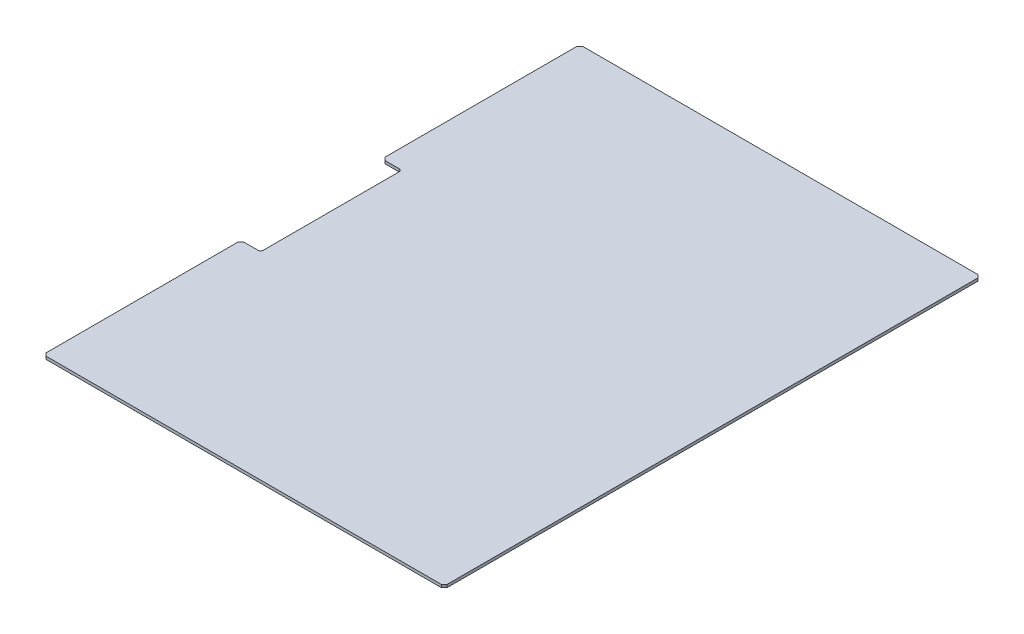
ISO-10303-21;
HEADER;
FILE_DESCRIPTION(('STEP AP214'),'2;1');
FILE_NAME('part.step','',(''),(''),'','','');
FILE_SCHEMA(('AUTOMOTIVE_DESIGN { 1 0 10303 214 1 1 1 1 }'));
ENDSEC;
DATA;
#1=APPLICATION_CONTEXT('core data for automotive mechanical design processes');
#2=APPLICATION_PROTOCOL_DEFINITION('international standard','automotive_design',2000,#1);
#3=PRODUCT_CONTEXT('',#1,'mechanical');
#4=PRODUCT('Part','Part','',(#3));
#5=PRODUCT_RELATED_PRODUCT_CATEGORY('part','',(#4));
#6=PRODUCT_DEFINITION_FORMATION('','',#4);
#7=PRODUCT_DEFINITION_CONTEXT('part definition',#1,'design');
#8=PRODUCT_DEFINITION('design','',#6,#7);
#9=PRODUCT_DEFINITION_SHAPE('','',#8);
#10=(LENGTH_UNIT() NAMED_UNIT(*) SI_UNIT(.MILLI.,.METRE.));
#11=(NAMED_UNIT(*) PLANE_ANGLE_UNIT() SI_UNIT($,.RADIAN.));
#12=(NAMED_UNIT(*) SI_UNIT($,.STERADIAN.) SOLID_ANGLE_UNIT());
#13=UNCERTAINTY_MEASURE_WITH_UNIT(LENGTH_MEASURE(1.E-05),#10,'distance_accuracy_value','');
#14=(GEOMETRIC_REPRESENTATION_CONTEXT(3) GLOBAL_UNCERTAINTY_ASSIGNED_CONTEXT((#13)) GLOBAL_UNIT_ASSIGNED_CONTEXT((#10,
#11,#12)) REPRESENTATION_CONTEXT('',''));
#15=CARTESIAN_POINT('',(0.,0.,0.));
#16=DIRECTION('',(0.,0.,1.));
#17=DIRECTION('',(1.,0.,0.));
#18=AXIS2_PLACEMENT_3D('',#15,#16,#17);
#19=CARTESIAN_POINT('',(50.8,-6.35,52.5536723434925));
#20=DIRECTION('',(-1.,0.,0.));
#21=DIRECTION('',(0.,0.,1.));
#22=AXIS2_PLACEMENT_3D('',#19,#20,#21);
#23=PLANE('',#22);
#24=DIRECTION('',(0.,0.,1.));
#25=VECTOR('',#24,1.);
#26=CARTESIAN_POINT('',(50.8,0.,52.5536723434925));
#27=LINE('',#26,#25);
#28=CARTESIAN_POINT('',(50.8,0.,768.35));
#29=VERTEX_POINT('',#28);
#30=CARTESIAN_POINT('',(50.8,0.,1200.15));
#31=VERTEX_POINT('',#30);
#32=EDGE_CURVE('E197',#29,#31,#27,.T.);
#33=ORIENTED_EDGE('',*,*,#32,.F.);
#34=DIRECTION('',(0.,-1.,0.));
#35=VECTOR('',#34,1.);
#36=CARTESIAN_POINT('',(50.8,-6.35,768.35));
#37=LINE('',#36,#35);
#38=CARTESIAN_POINT('',(50.8,-6.35,768.35));
#39=VERTEX_POINT('',#38);
#40=EDGE_CURVE('E171',#29,#39,#37,.T.);
#41=ORIENTED_EDGE('',*,*,#40,.T.);
#42=DIRECTION('',(0.,0.,1.));
#43=VECTOR('',#42,1.);
#44=CARTESIAN_POINT('',(50.8,-6.35,52.5536723434925));
#45=LINE('',#44,#43);
#46=CARTESIAN_POINT('',(50.8,-6.35,1200.15));
#47=VERTEX_POINT('',#46);
#48=EDGE_CURVE('E225',#39,#47,#45,.T.);
#49=ORIENTED_EDGE('',*,*,#48,.T.);
#50=DIRECTION('',(0.,1.,0.));
#51=VECTOR('',#50,1.);
#52=CARTESIAN_POINT('',(50.8,-6.35,1200.15));
#53=LINE('',#52,#51);
#54=EDGE_CURVE('E177',#47,#31,#53,.T.);
#55=ORIENTED_EDGE('',*,*,#54,.T.);
#56=EDGE_LOOP('',(#33,#41,#49,#55));
#57=FACE_BOUND('',#56,.T.);
#58=ADVANCED_FACE('F16',(#57),#23,.T.);
#59=CARTESIAN_POINT('',(121.105415511131,-6.35,762.));
#60=DIRECTION('',(0.,0.,1.));
#61=DIRECTION('',(1.,0.,0.));
#62=AXIS2_PLACEMENT_3D('',#59,#60,#61);
#63=PLANE('',#62);
#64=DIRECTION('',(1.,0.,0.));
#65=VECTOR('',#64,1.);
#66=CARTESIAN_POINT('',(121.105415511131,0.,762.));
#67=LINE('',#66,#65);
#68=CARTESIAN_POINT('',(57.15,0.,762.));
#69=VERTEX_POINT('',#68);
#70=CARTESIAN_POINT('',(88.9,0.,762.));
#71=VERTEX_POINT('',#70);
#72=EDGE_CURVE('E184',#69,#71,#67,.T.);
#73=ORIENTED_EDGE('',*,*,#72,.T.);
#74=DIRECTION('',(0.,1.,0.));
#75=VECTOR('',#74,1.);
#76=CARTESIAN_POINT('',(88.9,-6.35,762.));
#77=LINE('',#76,#75);
#78=CARTESIAN_POINT('',(88.9,-6.35,762.));
#79=VERTEX_POINT('',#78);
#80=EDGE_CURVE('E300',#71,#79,#77,.F.);
#81=ORIENTED_EDGE('',*,*,#80,.T.);
#82=DIRECTION('',(1.,0.,0.));
#83=VECTOR('',#82,1.);
#84=CARTESIAN_POINT('',(121.105415511131,-6.35,762.));
#85=LINE('',#84,#83);
#86=CARTESIAN_POINT('',(57.15,-6.35,762.));
#87=VERTEX_POINT('',#86);
#88=EDGE_CURVE('E187',#87,#79,#85,.T.);
#89=ORIENTED_EDGE('',*,*,#88,.F.);
#90=DIRECTION('',(0.,1.,0.));
#91=VECTOR('',#90,1.);
#92=CARTESIAN_POINT('',(57.15,0.,762.));
#93=LINE('',#92,#91);
#94=EDGE_CURVE('E170',#87,#69,#93,.T.);
#95=ORIENTED_EDGE('',*,*,#94,.T.);
#96=EDGE_LOOP('',(#73,#81,#89,#95));
#97=FACE_BOUND('',#96,.T.);
#98=ADVANCED_FACE('F183',(#97),#63,.F.);
#99=CARTESIAN_POINT('',(95.25,-6.35,626.005172729492));
#100=DIRECTION('',(1.,0.,0.));
#101=DIRECTION('',(0.,0.,-1.));
#102=AXIS2_PLACEMENT_3D('',#99,#100,#101);
#103=PLANE('',#102);
#104=DIRECTION('',(0.,0.,-1.));
#105=VECTOR('',#104,1.);
#106=CARTESIAN_POINT('',(95.25,-6.35,626.005172729492));
#107=LINE('',#106,#105);
#108=CARTESIAN_POINT('',(95.25,-6.35,755.65));
#109=VERTEX_POINT('',#108);
#110=CARTESIAN_POINT('',(95.25,-6.35,450.85));
#111=VERTEX_POINT('',#110);
#112=EDGE_CURVE('E325',#109,#111,#107,.T.);
#113=ORIENTED_EDGE('',*,*,#112,.F.);
#114=DIRECTION('',(0.,1.,0.));
#115=VECTOR('',#114,1.);
#116=CARTESIAN_POINT('',(95.25,0.,755.65));
#117=LINE('',#116,#115);
#118=CARTESIAN_POINT('',(95.25,0.,755.65));
#119=VERTEX_POINT('',#118);
#120=EDGE_CURVE('E296',#109,#119,#117,.T.);
#121=ORIENTED_EDGE('',*,*,#120,.T.);
#122=DIRECTION('',(0.,0.,-1.));
#123=VECTOR('',#122,1.);
#124=CARTESIAN_POINT('',(95.25,0.,626.005172729492));
#125=LINE('',#124,#123);
#126=CARTESIAN_POINT('',(95.25,0.,450.85));
#127=VERTEX_POINT('',#126);
#128=EDGE_CURVE('E196',#119,#127,#125,.T.);
#129=ORIENTED_EDGE('',*,*,#128,.T.);
#130=DIRECTION('',(0.,1.,0.));
#131=VECTOR('',#130,1.);
#132=CARTESIAN_POINT('',(95.25,-6.35,450.85));
#133=LINE('',#132,#131);
#134=EDGE_CURVE('E293',#127,#111,#133,.F.);
#135=ORIENTED_EDGE('',*,*,#134,.T.);
#136=EDGE_LOOP('',(#113,#121,#129,#135));
#137=FACE_BOUND('',#136,.T.);
#138=ADVANCED_FACE('F316',(#137),#103,.F.);
#139=CARTESIAN_POINT('',(121.105415511131,-6.35,444.5));
#140=DIRECTION('',(0.,0.,1.));
#141=DIRECTION('',(1.,0.,0.));
#142=AXIS2_PLACEMENT_3D('',#139,#140,#141);
#143=PLANE('',#142);
#144=DIRECTION('',(1.,0.,0.));
#145=VECTOR('',#144,1.);
#146=CARTESIAN_POINT('',(121.105415511131,-6.35,444.5));
#147=LINE('',#146,#145);
#148=CARTESIAN_POINT('',(57.15,-6.35,444.5));
#149=VERTEX_POINT('',#148);
#150=CARTESIAN_POINT('',(88.9,-6.35,444.5));
#151=VERTEX_POINT('',#150);
#152=EDGE_CURVE('E321',#149,#151,#147,.T.);
#153=ORIENTED_EDGE('',*,*,#152,.T.);
#154=DIRECTION('',(0.,1.,0.));
#155=VECTOR('',#154,1.);
#156=CARTESIAN_POINT('',(88.9,-6.35,444.5));
#157=LINE('',#156,#155);
#158=CARTESIAN_POINT('',(88.9,0.,444.5));
#159=VERTEX_POINT('',#158);
#160=EDGE_CURVE('E303',#151,#159,#157,.T.);
#161=ORIENTED_EDGE('',*,*,#160,.T.);
#162=DIRECTION('',(1.,0.,0.));
#163=VECTOR('',#162,1.);
#164=CARTESIAN_POINT('',(121.105415511131,0.,444.5));
#165=LINE('',#164,#163);
#166=CARTESIAN_POINT('',(57.15,0.,444.5));
#167=VERTEX_POINT('',#166);
#168=EDGE_CURVE('E204',#167,#159,#165,.T.);
#169=ORIENTED_EDGE('',*,*,#168,.F.);
#170=DIRECTION('',(0.,-1.,0.));
#171=VECTOR('',#170,1.);
#172=CARTESIAN_POINT('',(57.15,-6.35,444.5));
#173=LINE('',#172,#171);
#174=EDGE_CURVE('E269',#167,#149,#173,.T.);
#175=ORIENTED_EDGE('',*,*,#174,.T.);
#176=EDGE_LOOP('',(#153,#161,#169,#175));
#177=FACE_BOUND('',#176,.T.);
#178=ADVANCED_FACE('F319',(#177),#143,.T.);
#179=CARTESIAN_POINT('',(50.8,-6.35,6.35));
#180=VERTEX_POINT('',#179);
#181=CARTESIAN_POINT('',(50.8,-6.35,438.15));
#182=VERTEX_POINT('',#181);
#183=EDGE_CURVE('E324',#180,#182,#45,.T.);
#184=ORIENTED_EDGE('',*,*,#183,.T.);
#185=DIRECTION('',(0.,1.,0.));
#186=VECTOR('',#185,1.);
#187=CARTESIAN_POINT('',(50.8,-6.35,438.15));
#188=LINE('',#187,#186);
#189=CARTESIAN_POINT('',(50.8,0.,438.15));
#190=VERTEX_POINT('',#189);
#191=EDGE_CURVE('E265',#182,#190,#188,.T.);
#192=ORIENTED_EDGE('',*,*,#191,.T.);
#193=CARTESIAN_POINT('',(50.8,0.,6.35));
#194=VERTEX_POINT('',#193);
#195=EDGE_CURVE('E208',#194,#190,#27,.T.);
#196=ORIENTED_EDGE('',*,*,#195,.F.);
#197=DIRECTION('',(0.,-1.,0.));
#198=VECTOR('',#197,1.);
#199=CARTESIAN_POINT('',(50.8,-6.35,6.35));
#200=LINE('',#199,#198);
#201=EDGE_CURVE('E262',#194,#180,#200,.T.);
#202=ORIENTED_EDGE('',*,*,#201,.T.);
#203=EDGE_LOOP('',(#184,#192,#196,#202));
#204=FACE_BOUND('',#203,.T.);
#205=ADVANCED_FACE('F376',(#204),#23,.T.);
#206=CARTESIAN_POINT('',(123.701680451632,-6.35,0.));
#207=DIRECTION('',(0.,0.,1.));
#208=DIRECTION('',(1.,0.,0.));
#209=AXIS2_PLACEMENT_3D('',#206,#207,#208);
#210=PLANE('',#209);
#211=DIRECTION('',(1.,0.,0.));
#212=VECTOR('',#211,1.);
#213=CARTESIAN_POINT('',(123.701680451632,-6.35,0.));
#214=LINE('',#213,#212);
#215=CARTESIAN_POINT('',(57.15,-6.35,0.));
#216=VERTEX_POINT('',#215);
#217=CARTESIAN_POINT('',(946.15,-6.35,0.));
#218=VERTEX_POINT('',#217);
#219=EDGE_CURVE('E330',#216,#218,#214,.T.);
#220=ORIENTED_EDGE('',*,*,#219,.F.);
#221=DIRECTION('',(0.,1.,0.));
#222=VECTOR('',#221,1.);
#223=CARTESIAN_POINT('',(57.15,0.,0.));
#224=LINE('',#223,#222);
#225=CARTESIAN_POINT('',(57.15,0.,0.));
#226=VERTEX_POINT('',#225);
#227=EDGE_CURVE('E275',#216,#226,#224,.T.);
#228=ORIENTED_EDGE('',*,*,#227,.T.);
#229=DIRECTION('',(1.,0.,0.));
#230=VECTOR('',#229,1.);
#231=CARTESIAN_POINT('',(123.701680451632,0.,0.));
#232=LINE('',#231,#230);
#233=CARTESIAN_POINT('',(946.15,0.,0.));
#234=VERTEX_POINT('',#233);
#235=EDGE_CURVE('E214',#226,#234,#232,.T.);
#236=ORIENTED_EDGE('',*,*,#235,.T.);
#237=DIRECTION('',(0.,-1.,0.));
#238=VECTOR('',#237,1.);
#239=CARTESIAN_POINT('',(946.15,-6.35,0.));
#240=LINE('',#239,#238);
#241=EDGE_CURVE('E272',#234,#218,#240,.T.);
#242=ORIENTED_EDGE('',*,*,#241,.T.);
#243=EDGE_LOOP('',(#220,#228,#236,#242));
#244=FACE_BOUND('',#243,.T.);
#245=ADVANCED_FACE('F367',(#244),#210,.F.);
#246=CARTESIAN_POINT('',(952.5,-6.35,52.5536723434928));
#247=DIRECTION('',(-1.,0.,0.));
#248=DIRECTION('',(0.,0.,1.));
#249=AXIS2_PLACEMENT_3D('',#246,#247,#248);
#250=PLANE('',#249);
#251=DIRECTION('',(0.,0.,1.));
#252=VECTOR('',#251,1.);
#253=CARTESIAN_POINT('',(952.5,-6.35,52.5536723434928));
#254=LINE('',#253,#252);
#255=CARTESIAN_POINT('',(952.5,-6.35,6.35));
#256=VERTEX_POINT('',#255);
#257=CARTESIAN_POINT('',(952.5,-6.35,1200.15));
#258=VERTEX_POINT('',#257);
#259=EDGE_CURVE('E338',#256,#258,#254,.T.);
#260=ORIENTED_EDGE('',*,*,#259,.F.);
#261=DIRECTION('',(0.,1.,0.));
#262=VECTOR('',#261,1.);
#263=CARTESIAN_POINT('',(952.5,-6.35,6.35));
#264=LINE('',#263,#262);
#265=CARTESIAN_POINT('',(952.5,0.,6.35));
#266=VERTEX_POINT('',#265);
#267=EDGE_CURVE('E282',#256,#266,#264,.T.);
#268=ORIENTED_EDGE('',*,*,#267,.T.);
#269=DIRECTION('',(0.,0.,1.));
#270=VECTOR('',#269,1.);
#271=CARTESIAN_POINT('',(952.5,0.,52.5536723434928));
#272=LINE('',#271,#270);
#273=CARTESIAN_POINT('',(952.5,0.,1200.15));
#274=VERTEX_POINT('',#273);
#275=EDGE_CURVE('E218',#266,#274,#272,.T.);
#276=ORIENTED_EDGE('',*,*,#275,.T.);
#277=DIRECTION('',(0.,-1.,0.));
#278=VECTOR('',#277,1.);
#279=CARTESIAN_POINT('',(952.5,-6.35,1200.15));
#280=LINE('',#279,#278);
#281=EDGE_CURVE('E279',#274,#258,#280,.T.);
#282=ORIENTED_EDGE('',*,*,#281,.T.);
#283=EDGE_LOOP('',(#260,#268,#276,#282));
#284=FACE_BOUND('',#283,.T.);
#285=ADVANCED_FACE('F358',(#284),#250,.F.);
#286=CARTESIAN_POINT('',(123.701680451632,-6.35,1206.5));
#287=DIRECTION('',(0.,0.,1.));
#288=DIRECTION('',(1.,0.,0.));
#289=AXIS2_PLACEMENT_3D('',#286,#287,#288);
#290=PLANE('',#289);
#291=DIRECTION('',(1.,0.,0.));
#292=VECTOR('',#291,1.);
#293=CARTESIAN_POINT('',(123.701680451632,0.,1206.5));
#294=LINE('',#293,#292);
#295=CARTESIAN_POINT('',(57.15,0.,1206.5));
#296=VERTEX_POINT('',#295);
#297=CARTESIAN_POINT('',(946.15,0.,1206.5));
#298=VERTEX_POINT('',#297);
#299=EDGE_CURVE('E222',#296,#298,#294,.T.);
#300=ORIENTED_EDGE('',*,*,#299,.F.);
#301=DIRECTION('',(0.,-1.,0.));
#302=VECTOR('',#301,1.);
#303=CARTESIAN_POINT('',(57.15,-6.35,1206.5));
#304=LINE('',#303,#302);
#305=CARTESIAN_POINT('',(57.15,-6.35,1206.5));
#306=VERTEX_POINT('',#305);
#307=EDGE_CURVE('E290',#296,#306,#304,.T.);
#308=ORIENTED_EDGE('',*,*,#307,.T.);
#309=DIRECTION('',(1.,0.,0.));
#310=VECTOR('',#309,1.);
#311=CARTESIAN_POINT('',(123.701680451632,-6.35,1206.5));
#312=LINE('',#311,#310);
#313=CARTESIAN_POINT('',(946.15,-6.35,1206.5));
#314=VERTEX_POINT('',#313);
#315=EDGE_CURVE('E190',#306,#314,#312,.T.);
#316=ORIENTED_EDGE('',*,*,#315,.T.);
#317=DIRECTION('',(0.,1.,0.));
#318=VECTOR('',#317,1.);
#319=CARTESIAN_POINT('',(946.15,0.,1206.5));
#320=LINE('',#319,#318);
#321=EDGE_CURVE('E286',#314,#298,#320,.T.);
#322=ORIENTED_EDGE('',*,*,#321,.T.);
#323=EDGE_LOOP('',(#300,#308,#316,#322));
#324=FACE_BOUND('',#323,.T.);
#325=ADVANCED_FACE('F348',(#324),#290,.T.);
#326=CARTESIAN_POINT('',(501.65,-6.35,603.25));
#327=DIRECTION('',(0.,-1.,0.));
#328=DIRECTION('',(1.,0.,0.));
#329=AXIS2_PLACEMENT_3D('',#326,#327,#328);
#330=PLANE('',#329);
#331=ORIENTED_EDGE('',*,*,#48,.F.);
#332=DIRECTION('',(0.707106781186557,0.,-0.707106781186538));
#333=VECTOR('',#332,1.);
#334=CARTESIAN_POINT('',(358.775000000005,-6.35,460.375));
#335=LINE('',#334,#333);
#336=EDGE_CURVE('E260',#39,#87,#335,.T.);
#337=ORIENTED_EDGE('',*,*,#336,.T.);
#338=ORIENTED_EDGE('',*,*,#88,.T.);
#339=CARTESIAN_POINT('',(88.9,-6.35,755.65));
#340=DIRECTION('',(0.,-1.,0.));
#341=DIRECTION('',(0.,0.,-1.));
#342=AXIS2_PLACEMENT_3D('',#339,#340,#341);
#343=CIRCLE('',#342,6.35);
#344=EDGE_CURVE('E308',#79,#109,#343,.F.);
#345=ORIENTED_EDGE('',*,*,#344,.T.);
#346=ORIENTED_EDGE('',*,*,#112,.T.);
#347=CARTESIAN_POINT('',(88.9,-6.35,450.85));
#348=DIRECTION('',(0.,-1.,0.));
#349=DIRECTION('',(0.,0.,-1.));
#350=AXIS2_PLACEMENT_3D('',#347,#348,#349);
#351=CIRCLE('',#350,6.35);
#352=EDGE_CURVE('E11',#111,#151,#351,.F.);
#353=ORIENTED_EDGE('',*,*,#352,.T.);
#354=ORIENTED_EDGE('',*,*,#152,.F.);
#355=DIRECTION('',(0.707106781186547,0.,0.707106781186548));
#356=VECTOR('',#355,1.);
#357=CARTESIAN_POINT('',(358.775,-6.35,746.125));
#358=LINE('',#357,#356);
#359=EDGE_CURVE('E257',#149,#182,#358,.F.);
#360=ORIENTED_EDGE('',*,*,#359,.T.);
#361=ORIENTED_EDGE('',*,*,#183,.F.);
#362=DIRECTION('',(0.707106781186548,0.,-0.707106781186548));
#363=VECTOR('',#362,1.);
#364=CARTESIAN_POINT('',(-22.225,-6.35,79.375));
#365=LINE('',#364,#363);
#366=EDGE_CURVE('E254',#180,#216,#365,.T.);
#367=ORIENTED_EDGE('',*,*,#366,.T.);
#368=ORIENTED_EDGE('',*,*,#219,.T.);
#369=DIRECTION('',(-0.707106781186545,0.,-0.70710678118655));
#370=VECTOR('',#369,1.);
#371=CARTESIAN_POINT('',(1025.525,-6.35,79.375000000002));
#372=LINE('',#371,#370);
#373=EDGE_CURVE('E251',#218,#256,#372,.F.);
#374=ORIENTED_EDGE('',*,*,#373,.T.);
#375=ORIENTED_EDGE('',*,*,#259,.T.);
#376=DIRECTION('',(-0.707106781186529,0.,0.707106781186566));
#377=VECTOR('',#376,1.);
#378=CARTESIAN_POINT('',(1025.52500000001,-6.35,1127.12499999998));
#379=LINE('',#378,#377);
#380=EDGE_CURVE('E245',#258,#314,#379,.T.);
#381=ORIENTED_EDGE('',*,*,#380,.T.);
#382=ORIENTED_EDGE('',*,*,#315,.F.);
#383=DIRECTION('',(0.707106781186532,0.,0.707106781186563));
#384=VECTOR('',#383,1.);
#385=CARTESIAN_POINT('',(-22.2250000000101,-6.35,1127.12499999999));
#386=LINE('',#385,#384);
#387=EDGE_CURVE('E248',#306,#47,#386,.F.);
#388=ORIENTED_EDGE('',*,*,#387,.T.);
#389=EDGE_LOOP('',(#331,#337,#338,#345,#346,#353,#354,#360,#361,#367,#368,#374,#375,#381,#382,#388));
#390=FACE_BOUND('',#389,.T.);
#391=ADVANCED_FACE('F583',(#390),#330,.T.);
#392=CARTESIAN_POINT('',(501.65,0.,603.25));
#393=DIRECTION('',(0.,-1.,0.));
#394=DIRECTION('',(1.,0.,0.));
#395=AXIS2_PLACEMENT_3D('',#392,#393,#394);
#396=PLANE('',#395);
#397=ORIENTED_EDGE('',*,*,#72,.F.);
#398=DIRECTION('',(-0.707106781186557,0.,0.707106781186538));
#399=VECTOR('',#398,1.);
#400=CARTESIAN_POINT('',(57.15,0.,762.));
#401=LINE('',#400,#399);
#402=EDGE_CURVE('E166',#69,#29,#401,.T.);
#403=ORIENTED_EDGE('',*,*,#402,.T.);
#404=ORIENTED_EDGE('',*,*,#32,.T.);
#405=DIRECTION('',(-0.707106781186532,0.,-0.707106781186563));
#406=VECTOR('',#405,1.);
#407=CARTESIAN_POINT('',(50.8,0.,1200.15));
#408=LINE('',#407,#406);
#409=EDGE_CURVE('E229',#31,#296,#408,.F.);
#410=ORIENTED_EDGE('',*,*,#409,.T.);
#411=ORIENTED_EDGE('',*,*,#299,.T.);
#412=DIRECTION('',(0.707106781186529,0.,-0.707106781186566));
#413=VECTOR('',#412,1.);
#414=CARTESIAN_POINT('',(946.15,0.,1206.5));
#415=LINE('',#414,#413);
#416=EDGE_CURVE('E189',#298,#274,#415,.T.);
#417=ORIENTED_EDGE('',*,*,#416,.T.);
#418=ORIENTED_EDGE('',*,*,#275,.F.);
#419=DIRECTION('',(0.707106781186545,0.,0.70710678118655));
#420=VECTOR('',#419,1.);
#421=CARTESIAN_POINT('',(952.5,0.,6.35));
#422=LINE('',#421,#420);
#423=EDGE_CURVE('E232',#266,#234,#422,.F.);
#424=ORIENTED_EDGE('',*,*,#423,.T.);
#425=ORIENTED_EDGE('',*,*,#235,.F.);
#426=DIRECTION('',(-0.707106781186548,0.,0.707106781186548));
#427=VECTOR('',#426,1.);
#428=CARTESIAN_POINT('',(57.15,0.,0.));
#429=LINE('',#428,#427);
#430=EDGE_CURVE('E235',#226,#194,#429,.T.);
#431=ORIENTED_EDGE('',*,*,#430,.T.);
#432=ORIENTED_EDGE('',*,*,#195,.T.);
#433=DIRECTION('',(-0.707106781186547,0.,-0.707106781186548));
#434=VECTOR('',#433,1.);
#435=CARTESIAN_POINT('',(50.8,0.,438.15));
#436=LINE('',#435,#434);
#437=EDGE_CURVE('E178',#190,#167,#436,.F.);
#438=ORIENTED_EDGE('',*,*,#437,.T.);
#439=ORIENTED_EDGE('',*,*,#168,.T.);
#440=CARTESIAN_POINT('',(88.9,0.,450.85));
#441=DIRECTION('',(0.,-1.,0.));
#442=DIRECTION('',(0.,0.,-1.));
#443=AXIS2_PLACEMENT_3D('',#440,#441,#442);
#444=CIRCLE('',#443,6.35);
#445=EDGE_CURVE('E25',#159,#127,#444,.T.);
#446=ORIENTED_EDGE('',*,*,#445,.T.);
#447=ORIENTED_EDGE('',*,*,#128,.F.);
#448=CARTESIAN_POINT('',(88.9,0.,755.65));
#449=DIRECTION('',(0.,-1.,0.));
#450=DIRECTION('',(0.,0.,-1.));
#451=AXIS2_PLACEMENT_3D('',#448,#449,#450);
#452=CIRCLE('',#451,6.35);
#453=EDGE_CURVE('E194',#119,#71,#452,.T.);
#454=ORIENTED_EDGE('',*,*,#453,.T.);
#455=EDGE_LOOP('',(#397,#403,#404,#410,#411,#417,#418,#424,#425,#431,#432,#438,#439,#446,#447,#454));
#456=FACE_BOUND('',#455,.T.);
#457=ADVANCED_FACE('F192',(#456),#396,.F.);
#458=CARTESIAN_POINT('',(57.15,-6.35,762.));
#459=DIRECTION('',(-0.707106781186538,0.,-0.707106781186557));
#460=DIRECTION('',(0.,-1.,0.));
#461=AXIS2_PLACEMENT_3D('',#458,#459,#460);
#462=PLANE('',#461);
#463=ORIENTED_EDGE('',*,*,#336,.F.);
#464=ORIENTED_EDGE('',*,*,#40,.F.);
#465=ORIENTED_EDGE('',*,*,#402,.F.);
#466=ORIENTED_EDGE('',*,*,#94,.F.);
#467=EDGE_LOOP('',(#463,#464,#465,#466));
#468=FACE_BOUND('',#467,.T.);
#469=ADVANCED_FACE('F169',(#468),#462,.T.);
#470=CARTESIAN_POINT('',(50.8,-6.35,438.15));
#471=DIRECTION('',(0.707106781186548,0.,-0.707106781186547));
#472=DIRECTION('',(0.,1.,0.));
#473=AXIS2_PLACEMENT_3D('',#470,#471,#472);
#474=PLANE('',#473);
#475=ORIENTED_EDGE('',*,*,#359,.F.);
#476=ORIENTED_EDGE('',*,*,#174,.F.);
#477=ORIENTED_EDGE('',*,*,#437,.F.);
#478=ORIENTED_EDGE('',*,*,#191,.F.);
#479=EDGE_LOOP('',(#475,#476,#477,#478));
#480=FACE_BOUND('',#479,.T.);
#481=ADVANCED_FACE('F596',(#480),#474,.F.);
#482=CARTESIAN_POINT('',(57.15,-6.35,0.));
#483=DIRECTION('',(-0.707106781186548,0.,-0.707106781186548));
#484=DIRECTION('',(0.,-1.,0.));
#485=AXIS2_PLACEMENT_3D('',#482,#483,#484);
#486=PLANE('',#485);
#487=ORIENTED_EDGE('',*,*,#366,.F.);
#488=ORIENTED_EDGE('',*,*,#201,.F.);
#489=ORIENTED_EDGE('',*,*,#430,.F.);
#490=ORIENTED_EDGE('',*,*,#227,.F.);
#491=EDGE_LOOP('',(#487,#488,#489,#490));
#492=FACE_BOUND('',#491,.T.);
#493=ADVANCED_FACE('F371',(#492),#486,.T.);
#494=CARTESIAN_POINT('',(952.5,-6.35,6.35));
#495=DIRECTION('',(-0.70710678118655,0.,0.707106781186545));
#496=DIRECTION('',(0.,1.,0.));
#497=AXIS2_PLACEMENT_3D('',#494,#495,#496);
#498=PLANE('',#497);
#499=ORIENTED_EDGE('',*,*,#373,.F.);
#500=ORIENTED_EDGE('',*,*,#241,.F.);
#501=ORIENTED_EDGE('',*,*,#423,.F.);
#502=ORIENTED_EDGE('',*,*,#267,.F.);
#503=EDGE_LOOP('',(#499,#500,#501,#502));
#504=FACE_BOUND('',#503,.T.);
#505=ADVANCED_FACE('F362',(#504),#498,.F.);
#506=CARTESIAN_POINT('',(50.8,-6.35,1200.15));
#507=DIRECTION('',(0.707106781186563,0.,-0.707106781186532));
#508=DIRECTION('',(0.,1.,0.));
#509=AXIS2_PLACEMENT_3D('',#506,#507,#508);
#510=PLANE('',#509);
#511=ORIENTED_EDGE('',*,*,#387,.F.);
#512=ORIENTED_EDGE('',*,*,#307,.F.);
#513=ORIENTED_EDGE('',*,*,#409,.F.);
#514=ORIENTED_EDGE('',*,*,#54,.F.);
#515=EDGE_LOOP('',(#511,#512,#513,#514));
#516=FACE_BOUND('',#515,.T.);
#517=ADVANCED_FACE('F621',(#516),#510,.F.);
#518=CARTESIAN_POINT('',(946.15,-6.35,1206.5));
#519=DIRECTION('',(0.707106781186566,0.,0.707106781186529));
#520=DIRECTION('',(0.,-1.,0.));
#521=AXIS2_PLACEMENT_3D('',#518,#519,#520);
#522=PLANE('',#521);
#523=ORIENTED_EDGE('',*,*,#380,.F.);
#524=ORIENTED_EDGE('',*,*,#281,.F.);
#525=ORIENTED_EDGE('',*,*,#416,.F.);
#526=ORIENTED_EDGE('',*,*,#321,.F.);
#527=EDGE_LOOP('',(#523,#524,#525,#526));
#528=FACE_BOUND('',#527,.T.);
#529=ADVANCED_FACE('F353',(#528),#522,.T.);
#530=CARTESIAN_POINT('',(88.9,-6.35,755.65));
#531=DIRECTION('',(0.,-1.,0.));
#532=DIRECTION('',(0.,0.,-1.));
#533=AXIS2_PLACEMENT_3D('',#530,#531,#532);
#534=CYLINDRICAL_SURFACE('',#533,6.35);
#535=ORIENTED_EDGE('',*,*,#344,.F.);
#536=ORIENTED_EDGE('',*,*,#80,.F.);
#537=ORIENTED_EDGE('',*,*,#453,.F.);
#538=ORIENTED_EDGE('',*,*,#120,.F.);
#539=EDGE_LOOP('',(#535,#536,#537,#538));
#540=FACE_BOUND('',#539,.T.);
#541=ADVANCED_FACE('F620',(#540),#534,.F.);
#542=CARTESIAN_POINT('',(88.9,-6.35,450.85));
#543=DIRECTION('',(0.,1.,0.));
#544=DIRECTION('',(0.,0.,1.));
#545=AXIS2_PLACEMENT_3D('',#542,#543,#544);
#546=CYLINDRICAL_SURFACE('',#545,6.35);
#547=ORIENTED_EDGE('',*,*,#352,.F.);
#548=ORIENTED_EDGE('',*,*,#134,.F.);
#549=ORIENTED_EDGE('',*,*,#445,.F.);
#550=ORIENTED_EDGE('',*,*,#160,.F.);
#551=EDGE_LOOP('',(#547,#548,#549,#550));
#552=FACE_BOUND('',#551,.T.);
#553=ADVANCED_FACE('F18',(#552),#546,.F.);
#554=CLOSED_SHELL('',(#58,#98,#138,#178,#205,#245,#285,#325,#391,#457,#469,#481,#493,#505,#517,
#529,#541,#553));
#555=MANIFOLD_SOLID_BREP('B1',#554);
#556=ADVANCED_BREP_SHAPE_REPRESENTATION('',(#18,#555),#14);
#557=SHAPE_DEFINITION_REPRESENTATION(#9,#556);
ENDSEC;
END-ISO-10303-21;
